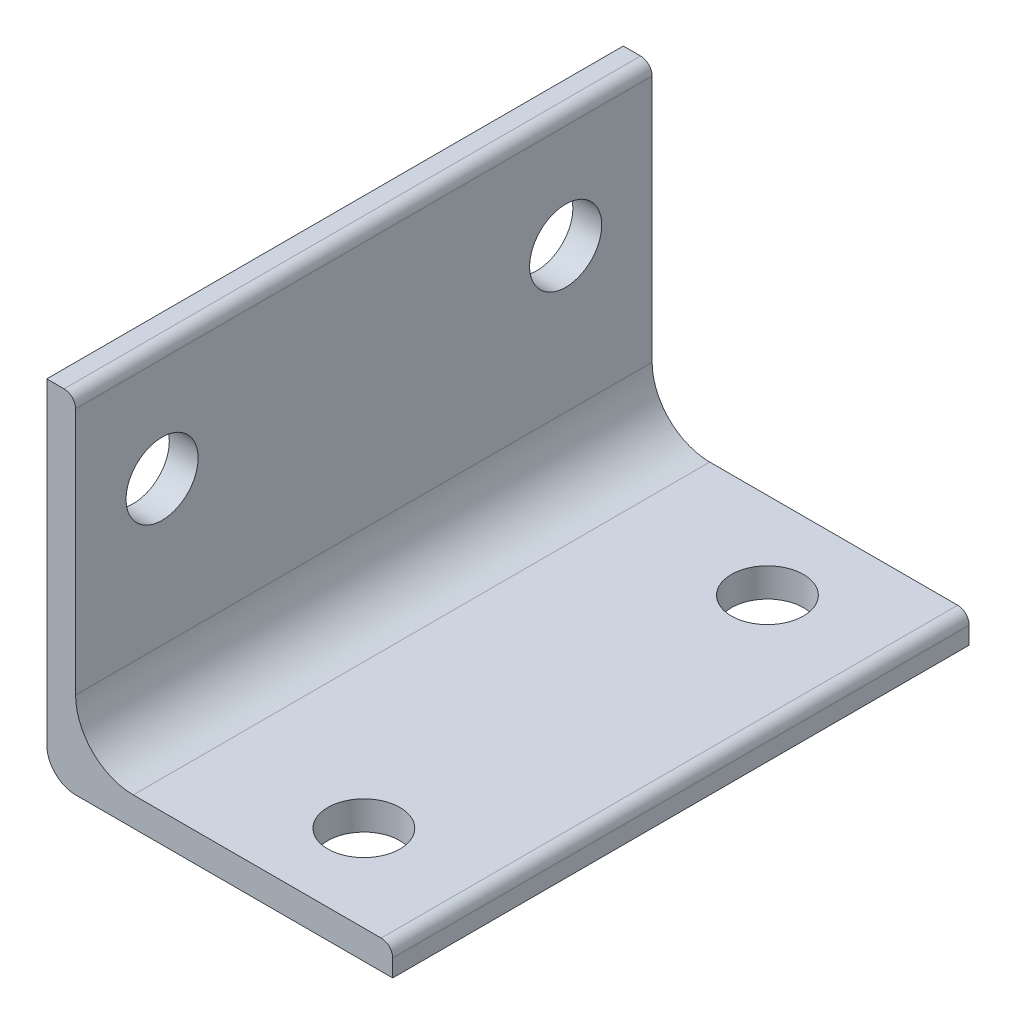
ISO-10303-21;
HEADER;
FILE_DESCRIPTION(('STEP AP214'),'2;1');
FILE_NAME('part.step','',(''),(''),'','','');
FILE_SCHEMA(('AUTOMOTIVE_DESIGN { 1 0 10303 214 1 1 1 1 }'));
ENDSEC;
DATA;
#1=APPLICATION_CONTEXT('core data for automotive mechanical design processes');
#2=APPLICATION_PROTOCOL_DEFINITION('international standard','automotive_design',2000,#1);
#3=PRODUCT_CONTEXT('',#1,'mechanical');
#4=PRODUCT('Part','Part','',(#3));
#5=PRODUCT_RELATED_PRODUCT_CATEGORY('part','',(#4));
#6=PRODUCT_DEFINITION_FORMATION('','',#4);
#7=PRODUCT_DEFINITION_CONTEXT('part definition',#1,'design');
#8=PRODUCT_DEFINITION('design','',#6,#7);
#9=PRODUCT_DEFINITION_SHAPE('','',#8);
#10=(LENGTH_UNIT() NAMED_UNIT(*) SI_UNIT(.MILLI.,.METRE.));
#11=(NAMED_UNIT(*) PLANE_ANGLE_UNIT() SI_UNIT($,.RADIAN.));
#12=(NAMED_UNIT(*) SI_UNIT($,.STERADIAN.) SOLID_ANGLE_UNIT());
#13=UNCERTAINTY_MEASURE_WITH_UNIT(LENGTH_MEASURE(1.E-05),#10,'distance_accuracy_value','');
#14=(GEOMETRIC_REPRESENTATION_CONTEXT(3) GLOBAL_UNCERTAINTY_ASSIGNED_CONTEXT((#13)) GLOBAL_UNIT_ASSIGNED_CONTEXT((#10,
#11,#12)) REPRESENTATION_CONTEXT('',''));
#15=CARTESIAN_POINT('',(0.,0.,0.));
#16=DIRECTION('',(0.,0.,1.));
#17=DIRECTION('',(1.,0.,0.));
#18=AXIS2_PLACEMENT_3D('',#15,#16,#17);
#19=CARTESIAN_POINT('',(6.35,6.34999999999999,63.5));
#20=DIRECTION('',(0.,0.,-1.));
#21=DIRECTION('',(-1.,0.,0.));
#22=AXIS2_PLACEMENT_3D('',#19,#20,#21);
#23=CYLINDRICAL_SURFACE('',#22,6.35);
#24=CARTESIAN_POINT('',(6.35,6.34999999999999,0.));
#25=DIRECTION('',(0.,0.,-1.));
#26=DIRECTION('',(1.,0.,0.));
#27=AXIS2_PLACEMENT_3D('',#24,#25,#26);
#28=CIRCLE('',#27,6.35);
#29=CARTESIAN_POINT('',(6.35,0.,0.));
#30=VERTEX_POINT('',#29);
#31=CARTESIAN_POINT('',(0.,6.34999999999999,0.));
#32=VERTEX_POINT('',#31);
#33=EDGE_CURVE('E152',#30,#32,#28,.T.);
#34=ORIENTED_EDGE('',*,*,#33,.T.);
#35=DIRECTION('',(0.,0.,-1.));
#36=VECTOR('',#35,1.);
#37=CARTESIAN_POINT('',(0.,6.34999999999999,63.5));
#38=LINE('',#37,#36);
#39=CARTESIAN_POINT('',(0.,6.34999999999999,63.5));
#40=VERTEX_POINT('',#39);
#41=EDGE_CURVE('E11',#40,#32,#38,.T.);
#42=ORIENTED_EDGE('',*,*,#41,.F.);
#43=CARTESIAN_POINT('',(6.35,6.34999999999999,63.5));
#44=DIRECTION('',(0.,0.,-1.));
#45=DIRECTION('',(1.,0.,0.));
#46=AXIS2_PLACEMENT_3D('',#43,#44,#45);
#47=CIRCLE('',#46,6.35);
#48=CARTESIAN_POINT('',(6.35,0.,63.5));
#49=VERTEX_POINT('',#48);
#50=EDGE_CURVE('E181',#49,#40,#47,.T.);
#51=ORIENTED_EDGE('',*,*,#50,.F.);
#52=DIRECTION('',(0.,0.,-1.));
#53=VECTOR('',#52,1.);
#54=CARTESIAN_POINT('',(6.35,0.,63.5));
#55=LINE('',#54,#53);
#56=EDGE_CURVE('E148',#49,#30,#55,.T.);
#57=ORIENTED_EDGE('',*,*,#56,.T.);
#58=EDGE_LOOP('',(#34,#42,#51,#57));
#59=FACE_BOUND('',#58,.T.);
#60=ADVANCED_FACE('F39',(#59),#23,.F.);
#61=CARTESIAN_POINT('',(0.,6.34999999999999,63.5));
#62=DIRECTION('',(-1.,0.,0.));
#63=DIRECTION('',(0.,-1.,0.));
#64=AXIS2_PLACEMENT_3D('',#61,#62,#63);
#65=PLANE('',#64);
#66=CARTESIAN_POINT('',(0.,22.225,9.525));
#67=DIRECTION('',(1.,0.,0.));
#68=DIRECTION('',(0.,0.,-1.));
#69=AXIS2_PLACEMENT_3D('',#66,#67,#68);
#70=CIRCLE('',#69,3.96875);
#71=CARTESIAN_POINT('',(0.,22.225,5.55625));
#72=VERTEX_POINT('',#71);
#73=EDGE_CURVE('E254',#72,#72,#70,.T.);
#74=ORIENTED_EDGE('',*,*,#73,.F.);
#75=EDGE_LOOP('',(#74));
#76=FACE_BOUND('',#75,.T.);
#77=CARTESIAN_POINT('',(0.,22.225,53.975));
#78=DIRECTION('',(1.,0.,0.));
#79=DIRECTION('',(0.,0.,-1.));
#80=AXIS2_PLACEMENT_3D('',#77,#78,#79);
#81=CIRCLE('',#80,3.96875);
#82=CARTESIAN_POINT('',(0.,22.225,50.00625));
#83=VERTEX_POINT('',#82);
#84=EDGE_CURVE('E246',#83,#83,#81,.T.);
#85=ORIENTED_EDGE('',*,*,#84,.F.);
#86=EDGE_LOOP('',(#85));
#87=FACE_BOUND('',#86,.T.);
#88=DIRECTION('',(0.,1.,0.));
#89=VECTOR('',#88,1.);
#90=CARTESIAN_POINT('',(0.,6.34999999999999,0.));
#91=LINE('',#90,#89);
#92=CARTESIAN_POINT('',(0.,33.655,0.));
#93=VERTEX_POINT('',#92);
#94=EDGE_CURVE('E156',#32,#93,#91,.T.);
#95=ORIENTED_EDGE('',*,*,#94,.T.);
#96=DIRECTION('',(0.,0.,-1.));
#97=VECTOR('',#96,1.);
#98=CARTESIAN_POINT('',(0.,33.655,63.5));
#99=LINE('',#98,#97);
#100=CARTESIAN_POINT('',(0.,33.655,63.5));
#101=VERTEX_POINT('',#100);
#102=EDGE_CURVE('E48',#101,#93,#99,.T.);
#103=ORIENTED_EDGE('',*,*,#102,.F.);
#104=DIRECTION('',(0.,1.,0.));
#105=VECTOR('',#104,1.);
#106=CARTESIAN_POINT('',(0.,6.34999999999999,63.5));
#107=LINE('',#106,#105);
#108=EDGE_CURVE('E105',#40,#101,#107,.T.);
#109=ORIENTED_EDGE('',*,*,#108,.F.);
#110=ORIENTED_EDGE('',*,*,#41,.T.);
#111=EDGE_LOOP('',(#95,#103,#109,#110));
#112=FACE_BOUND('',#111,.T.);
#113=ADVANCED_FACE('F299',(#76,#87,#112),#65,.F.);
#114=CARTESIAN_POINT('',(-1.27,33.655,63.5));
#115=DIRECTION('',(0.,0.,-1.));
#116=DIRECTION('',(-1.,0.,0.));
#117=AXIS2_PLACEMENT_3D('',#114,#115,#116);
#118=CYLINDRICAL_SURFACE('',#117,1.27);
#119=CARTESIAN_POINT('',(-1.27,33.655,0.));
#120=DIRECTION('',(0.,0.,1.));
#121=DIRECTION('',(1.,0.,0.));
#122=AXIS2_PLACEMENT_3D('',#119,#120,#121);
#123=CIRCLE('',#122,1.27);
#124=CARTESIAN_POINT('',(-1.27,34.925,0.));
#125=VERTEX_POINT('',#124);
#126=EDGE_CURVE('E160',#93,#125,#123,.T.);
#127=ORIENTED_EDGE('',*,*,#126,.T.);
#128=DIRECTION('',(0.,0.,-1.));
#129=VECTOR('',#128,1.);
#130=CARTESIAN_POINT('',(-1.27,34.925,63.5));
#131=LINE('',#130,#129);
#132=CARTESIAN_POINT('',(-1.27,34.925,63.5));
#133=VERTEX_POINT('',#132);
#134=EDGE_CURVE('E200',#133,#125,#131,.T.);
#135=ORIENTED_EDGE('',*,*,#134,.F.);
#136=CARTESIAN_POINT('',(-1.27,33.655,63.5));
#137=DIRECTION('',(0.,0.,1.));
#138=DIRECTION('',(1.,0.,0.));
#139=AXIS2_PLACEMENT_3D('',#136,#137,#138);
#140=CIRCLE('',#139,1.27);
#141=EDGE_CURVE('E210',#101,#133,#140,.T.);
#142=ORIENTED_EDGE('',*,*,#141,.F.);
#143=ORIENTED_EDGE('',*,*,#102,.T.);
#144=EDGE_LOOP('',(#127,#135,#142,#143));
#145=FACE_BOUND('',#144,.T.);
#146=ADVANCED_FACE('F208',(#145),#118,.T.);
#147=CARTESIAN_POINT('',(-1.27,34.925,63.5));
#148=DIRECTION('',(0.,-1.,0.));
#149=DIRECTION('',(0.,0.,-1.));
#150=AXIS2_PLACEMENT_3D('',#147,#148,#149);
#151=PLANE('',#150);
#152=DIRECTION('',(-1.,0.,0.));
#153=VECTOR('',#152,1.);
#154=CARTESIAN_POINT('',(-1.27,34.925,0.));
#155=LINE('',#154,#153);
#156=CARTESIAN_POINT('',(-3.175,34.925,0.));
#157=VERTEX_POINT('',#156);
#158=EDGE_CURVE('E163',#125,#157,#155,.T.);
#159=ORIENTED_EDGE('',*,*,#158,.T.);
#160=DIRECTION('',(0.,0.,-1.));
#161=VECTOR('',#160,1.);
#162=CARTESIAN_POINT('',(-3.175,34.925,63.5));
#163=LINE('',#162,#161);
#164=CARTESIAN_POINT('',(-3.175,34.925,63.5));
#165=VERTEX_POINT('',#164);
#166=EDGE_CURVE('E196',#165,#157,#163,.T.);
#167=ORIENTED_EDGE('',*,*,#166,.F.);
#168=DIRECTION('',(-1.,0.,0.));
#169=VECTOR('',#168,1.);
#170=CARTESIAN_POINT('',(-1.27,34.925,63.5));
#171=LINE('',#170,#169);
#172=EDGE_CURVE('E229',#133,#165,#171,.T.);
#173=ORIENTED_EDGE('',*,*,#172,.F.);
#174=ORIENTED_EDGE('',*,*,#134,.T.);
#175=EDGE_LOOP('',(#159,#167,#173,#174));
#176=FACE_BOUND('',#175,.T.);
#177=ADVANCED_FACE('F219',(#176),#151,.F.);
#178=CARTESIAN_POINT('',(-3.175,34.925,63.5));
#179=DIRECTION('',(1.,0.,0.));
#180=DIRECTION('',(0.,1.,0.));
#181=AXIS2_PLACEMENT_3D('',#178,#179,#180);
#182=PLANE('',#181);
#183=CARTESIAN_POINT('',(-3.17499999999999,22.225,9.525));
#184=DIRECTION('',(1.,0.,0.));
#185=DIRECTION('',(0.,0.,-1.));
#186=AXIS2_PLACEMENT_3D('',#183,#184,#185);
#187=CIRCLE('',#186,3.96875);
#188=CARTESIAN_POINT('',(-3.17499999999999,22.225,5.55625));
#189=VERTEX_POINT('',#188);
#190=EDGE_CURVE('E250',#189,#189,#187,.T.);
#191=ORIENTED_EDGE('',*,*,#190,.T.);
#192=EDGE_LOOP('',(#191));
#193=FACE_BOUND('',#192,.T.);
#194=CARTESIAN_POINT('',(-3.17499999999999,22.225,53.975));
#195=DIRECTION('',(1.,0.,0.));
#196=DIRECTION('',(0.,0.,-1.));
#197=AXIS2_PLACEMENT_3D('',#194,#195,#196);
#198=CIRCLE('',#197,3.96875);
#199=CARTESIAN_POINT('',(-3.17499999999999,22.225,50.00625));
#200=VERTEX_POINT('',#199);
#201=EDGE_CURVE('E157',#200,#200,#198,.T.);
#202=ORIENTED_EDGE('',*,*,#201,.T.);
#203=EDGE_LOOP('',(#202));
#204=FACE_BOUND('',#203,.T.);
#205=DIRECTION('',(0.,-1.,0.));
#206=VECTOR('',#205,1.);
#207=CARTESIAN_POINT('',(-3.175,34.925,0.));
#208=LINE('',#207,#206);
#209=CARTESIAN_POINT('',(-3.175,0.,0.));
#210=VERTEX_POINT('',#209);
#211=EDGE_CURVE('E166',#157,#210,#208,.T.);
#212=ORIENTED_EDGE('',*,*,#211,.T.);
#213=DIRECTION('',(0.,0.,-1.));
#214=VECTOR('',#213,1.);
#215=CARTESIAN_POINT('',(-3.175,0.,63.5));
#216=LINE('',#215,#214);
#217=CARTESIAN_POINT('',(-3.175,0.,63.5));
#218=VERTEX_POINT('',#217);
#219=EDGE_CURVE('E192',#218,#210,#216,.T.);
#220=ORIENTED_EDGE('',*,*,#219,.F.);
#221=DIRECTION('',(0.,-1.,0.));
#222=VECTOR('',#221,1.);
#223=CARTESIAN_POINT('',(-3.175,34.925,63.5));
#224=LINE('',#223,#222);
#225=EDGE_CURVE('E225',#165,#218,#224,.T.);
#226=ORIENTED_EDGE('',*,*,#225,.F.);
#227=ORIENTED_EDGE('',*,*,#166,.T.);
#228=EDGE_LOOP('',(#212,#220,#226,#227));
#229=FACE_BOUND('',#228,.T.);
#230=ADVANCED_FACE('F223',(#193,#204,#229),#182,.F.);
#231=CARTESIAN_POINT('',(0.,0.,63.5));
#232=DIRECTION('',(0.,0.,-1.));
#233=DIRECTION('',(-1.,0.,0.));
#234=AXIS2_PLACEMENT_3D('',#231,#232,#233);
#235=CYLINDRICAL_SURFACE('',#234,3.17499999999998);
#236=CARTESIAN_POINT('',(0.,0.,0.));
#237=DIRECTION('',(0.,0.,1.));
#238=DIRECTION('',(1.,0.,0.));
#239=AXIS2_PLACEMENT_3D('',#236,#237,#238);
#240=CIRCLE('',#239,3.17499999999998);
#241=CARTESIAN_POINT('',(0.,-3.17499999999999,0.));
#242=VERTEX_POINT('',#241);
#243=EDGE_CURVE('E169',#210,#242,#240,.T.);
#244=ORIENTED_EDGE('',*,*,#243,.T.);
#245=DIRECTION('',(0.,0.,-1.));
#246=VECTOR('',#245,1.);
#247=CARTESIAN_POINT('',(0.,-3.17499999999999,63.5));
#248=LINE('',#247,#246);
#249=CARTESIAN_POINT('',(0.,-3.17499999999999,63.5));
#250=VERTEX_POINT('',#249);
#251=EDGE_CURVE('E188',#250,#242,#248,.T.);
#252=ORIENTED_EDGE('',*,*,#251,.F.);
#253=CARTESIAN_POINT('',(0.,0.,63.5));
#254=DIRECTION('',(0.,0.,1.));
#255=DIRECTION('',(1.,0.,0.));
#256=AXIS2_PLACEMENT_3D('',#253,#254,#255);
#257=CIRCLE('',#256,3.17499999999998);
#258=EDGE_CURVE('E228',#218,#250,#257,.T.);
#259=ORIENTED_EDGE('',*,*,#258,.F.);
#260=ORIENTED_EDGE('',*,*,#219,.T.);
#261=EDGE_LOOP('',(#244,#252,#259,#260));
#262=FACE_BOUND('',#261,.T.);
#263=ADVANCED_FACE('F312',(#262),#235,.T.);
#264=CARTESIAN_POINT('',(0.,-3.17499999999999,63.5));
#265=DIRECTION('',(0.,1.,0.));
#266=DIRECTION('',(-1.,0.,0.));
#267=AXIS2_PLACEMENT_3D('',#264,#265,#266);
#268=PLANE('',#267);
#269=CARTESIAN_POINT('',(22.225,-3.17499999999999,53.975));
#270=DIRECTION('',(0.,1.,0.));
#271=DIRECTION('',(0.,0.,1.));
#272=AXIS2_PLACEMENT_3D('',#269,#270,#271);
#273=CIRCLE('',#272,3.96875);
#274=CARTESIAN_POINT('',(22.225,-3.17499999999999,57.94375));
#275=VERTEX_POINT('',#274);
#276=EDGE_CURVE('E266',#275,#275,#273,.T.);
#277=ORIENTED_EDGE('',*,*,#276,.T.);
#278=EDGE_LOOP('',(#277));
#279=FACE_BOUND('',#278,.T.);
#280=CARTESIAN_POINT('',(22.225,-3.17499999999999,9.525));
#281=DIRECTION('',(0.,1.,0.));
#282=DIRECTION('',(0.,0.,1.));
#283=AXIS2_PLACEMENT_3D('',#280,#281,#282);
#284=CIRCLE('',#283,3.96875);
#285=CARTESIAN_POINT('',(22.225,-3.17499999999999,13.49375));
#286=VERTEX_POINT('',#285);
#287=EDGE_CURVE('E258',#286,#286,#284,.T.);
#288=ORIENTED_EDGE('',*,*,#287,.T.);
#289=EDGE_LOOP('',(#288));
#290=FACE_BOUND('',#289,.T.);
#291=DIRECTION('',(1.,0.,0.));
#292=VECTOR('',#291,1.);
#293=CARTESIAN_POINT('',(0.,-3.17499999999999,0.));
#294=LINE('',#293,#292);
#295=CARTESIAN_POINT('',(34.925,-3.17499999999999,0.));
#296=VERTEX_POINT('',#295);
#297=EDGE_CURVE('E172',#242,#296,#294,.T.);
#298=ORIENTED_EDGE('',*,*,#297,.T.);
#299=DIRECTION('',(0.,0.,-1.));
#300=VECTOR('',#299,1.);
#301=CARTESIAN_POINT('',(34.925,-3.17499999999999,63.5));
#302=LINE('',#301,#300);
#303=CARTESIAN_POINT('',(34.925,-3.17499999999999,63.5));
#304=VERTEX_POINT('',#303);
#305=EDGE_CURVE('E141',#304,#296,#302,.T.);
#306=ORIENTED_EDGE('',*,*,#305,.F.);
#307=DIRECTION('',(1.,0.,0.));
#308=VECTOR('',#307,1.);
#309=CARTESIAN_POINT('',(0.,-3.17499999999999,63.5));
#310=LINE('',#309,#308);
#311=EDGE_CURVE('E130',#250,#304,#310,.T.);
#312=ORIENTED_EDGE('',*,*,#311,.F.);
#313=ORIENTED_EDGE('',*,*,#251,.T.);
#314=EDGE_LOOP('',(#298,#306,#312,#313));
#315=FACE_BOUND('',#314,.T.);
#316=ADVANCED_FACE('F309',(#279,#290,#315),#268,.F.);
#317=CARTESIAN_POINT('',(34.925,-3.17499999999999,63.5));
#318=DIRECTION('',(-1.,0.,0.));
#319=DIRECTION('',(0.,-1.,0.));
#320=AXIS2_PLACEMENT_3D('',#317,#318,#319);
#321=PLANE('',#320);
#322=DIRECTION('',(0.,1.,0.));
#323=VECTOR('',#322,1.);
#324=CARTESIAN_POINT('',(34.925,-3.17499999999999,0.));
#325=LINE('',#324,#323);
#326=CARTESIAN_POINT('',(34.925,-1.27,0.));
#327=VERTEX_POINT('',#326);
#328=EDGE_CURVE('E139',#296,#327,#325,.T.);
#329=ORIENTED_EDGE('',*,*,#328,.T.);
#330=DIRECTION('',(0.,0.,-1.));
#331=VECTOR('',#330,1.);
#332=CARTESIAN_POINT('',(34.925,-1.27,63.5));
#333=LINE('',#332,#331);
#334=CARTESIAN_POINT('',(34.925,-1.27,63.5));
#335=VERTEX_POINT('',#334);
#336=EDGE_CURVE('E136',#335,#327,#333,.T.);
#337=ORIENTED_EDGE('',*,*,#336,.F.);
#338=DIRECTION('',(0.,1.,0.));
#339=VECTOR('',#338,1.);
#340=CARTESIAN_POINT('',(34.925,-3.17499999999999,63.5));
#341=LINE('',#340,#339);
#342=EDGE_CURVE('E124',#304,#335,#341,.T.);
#343=ORIENTED_EDGE('',*,*,#342,.F.);
#344=ORIENTED_EDGE('',*,*,#305,.T.);
#345=EDGE_LOOP('',(#329,#337,#343,#344));
#346=FACE_BOUND('',#345,.T.);
#347=ADVANCED_FACE('F137',(#346),#321,.F.);
#348=CARTESIAN_POINT('',(33.655,-1.27,63.5));
#349=DIRECTION('',(0.,0.,-1.));
#350=DIRECTION('',(-1.,0.,0.));
#351=AXIS2_PLACEMENT_3D('',#348,#349,#350);
#352=CYLINDRICAL_SURFACE('',#351,1.27);
#353=CARTESIAN_POINT('',(33.655,-1.27,0.));
#354=DIRECTION('',(0.,0.,1.));
#355=DIRECTION('',(1.,0.,0.));
#356=AXIS2_PLACEMENT_3D('',#353,#354,#355);
#357=CIRCLE('',#356,1.27);
#358=CARTESIAN_POINT('',(33.655,0.,0.));
#359=VERTEX_POINT('',#358);
#360=EDGE_CURVE('E91',#327,#359,#357,.T.);
#361=ORIENTED_EDGE('',*,*,#360,.T.);
#362=DIRECTION('',(0.,0.,-1.));
#363=VECTOR('',#362,1.);
#364=CARTESIAN_POINT('',(33.655,0.,63.5));
#365=LINE('',#364,#363);
#366=CARTESIAN_POINT('',(33.655,0.,63.5));
#367=VERTEX_POINT('',#366);
#368=EDGE_CURVE('E142',#367,#359,#365,.T.);
#369=ORIENTED_EDGE('',*,*,#368,.F.);
#370=CARTESIAN_POINT('',(33.655,-1.27,63.5));
#371=DIRECTION('',(0.,0.,1.));
#372=DIRECTION('',(1.,0.,0.));
#373=AXIS2_PLACEMENT_3D('',#370,#371,#372);
#374=CIRCLE('',#373,1.27);
#375=EDGE_CURVE('E128',#335,#367,#374,.T.);
#376=ORIENTED_EDGE('',*,*,#375,.F.);
#377=ORIENTED_EDGE('',*,*,#336,.T.);
#378=EDGE_LOOP('',(#361,#369,#376,#377));
#379=FACE_BOUND('',#378,.T.);
#380=ADVANCED_FACE('F144',(#379),#352,.T.);
#381=CARTESIAN_POINT('',(33.655,0.,63.5));
#382=DIRECTION('',(0.,-1.,0.));
#383=DIRECTION('',(1.,0.,0.));
#384=AXIS2_PLACEMENT_3D('',#381,#382,#383);
#385=PLANE('',#384);
#386=CARTESIAN_POINT('',(22.225,0.,53.975));
#387=DIRECTION('',(0.,1.,0.));
#388=DIRECTION('',(0.,0.,1.));
#389=AXIS2_PLACEMENT_3D('',#386,#387,#388);
#390=CIRCLE('',#389,3.96875);
#391=CARTESIAN_POINT('',(22.225,0.,57.94375));
#392=VERTEX_POINT('',#391);
#393=EDGE_CURVE('E270',#392,#392,#390,.T.);
#394=ORIENTED_EDGE('',*,*,#393,.F.);
#395=EDGE_LOOP('',(#394));
#396=FACE_BOUND('',#395,.T.);
#397=CARTESIAN_POINT('',(22.225,0.,9.525));
#398=DIRECTION('',(0.,1.,0.));
#399=DIRECTION('',(0.,0.,1.));
#400=AXIS2_PLACEMENT_3D('',#397,#398,#399);
#401=CIRCLE('',#400,3.96875);
#402=CARTESIAN_POINT('',(22.225,0.,13.49375));
#403=VERTEX_POINT('',#402);
#404=EDGE_CURVE('E262',#403,#403,#401,.T.);
#405=ORIENTED_EDGE('',*,*,#404,.F.);
#406=EDGE_LOOP('',(#405));
#407=FACE_BOUND('',#406,.T.);
#408=DIRECTION('',(-1.,0.,0.));
#409=VECTOR('',#408,1.);
#410=CARTESIAN_POINT('',(33.655,0.,0.));
#411=LINE('',#410,#409);
#412=EDGE_CURVE('E97',#359,#30,#411,.T.);
#413=ORIENTED_EDGE('',*,*,#412,.T.);
#414=ORIENTED_EDGE('',*,*,#56,.F.);
#415=DIRECTION('',(-1.,0.,0.));
#416=VECTOR('',#415,1.);
#417=CARTESIAN_POINT('',(33.655,0.,63.5));
#418=LINE('',#417,#416);
#419=EDGE_CURVE('E56',#367,#49,#418,.T.);
#420=ORIENTED_EDGE('',*,*,#419,.F.);
#421=ORIENTED_EDGE('',*,*,#368,.T.);
#422=EDGE_LOOP('',(#413,#414,#420,#421));
#423=FACE_BOUND('',#422,.T.);
#424=ADVANCED_FACE('F277',(#396,#407,#423),#385,.F.);
#425=CARTESIAN_POINT('',(6.35,6.34999999999999,63.5));
#426=DIRECTION('',(0.,0.,1.));
#427=DIRECTION('',(1.,0.,0.));
#428=AXIS2_PLACEMENT_3D('',#425,#426,#427);
#429=PLANE('',#428);
#430=ORIENTED_EDGE('',*,*,#50,.T.);
#431=ORIENTED_EDGE('',*,*,#108,.T.);
#432=ORIENTED_EDGE('',*,*,#141,.T.);
#433=ORIENTED_EDGE('',*,*,#172,.T.);
#434=ORIENTED_EDGE('',*,*,#225,.T.);
#435=ORIENTED_EDGE('',*,*,#258,.T.);
#436=ORIENTED_EDGE('',*,*,#311,.T.);
#437=ORIENTED_EDGE('',*,*,#342,.T.);
#438=ORIENTED_EDGE('',*,*,#375,.T.);
#439=ORIENTED_EDGE('',*,*,#419,.T.);
#440=EDGE_LOOP('',(#430,#431,#432,#433,#434,#435,#436,#437,#438,#439));
#441=FACE_BOUND('',#440,.T.);
#442=ADVANCED_FACE('F126',(#441),#429,.T.);
#443=CARTESIAN_POINT('',(6.35,6.34999999999999,0.));
#444=DIRECTION('',(0.,0.,1.));
#445=DIRECTION('',(1.,0.,0.));
#446=AXIS2_PLACEMENT_3D('',#443,#444,#445);
#447=PLANE('',#446);
#448=ORIENTED_EDGE('',*,*,#33,.F.);
#449=ORIENTED_EDGE('',*,*,#412,.F.);
#450=ORIENTED_EDGE('',*,*,#360,.F.);
#451=ORIENTED_EDGE('',*,*,#328,.F.);
#452=ORIENTED_EDGE('',*,*,#297,.F.);
#453=ORIENTED_EDGE('',*,*,#243,.F.);
#454=ORIENTED_EDGE('',*,*,#211,.F.);
#455=ORIENTED_EDGE('',*,*,#158,.F.);
#456=ORIENTED_EDGE('',*,*,#126,.F.);
#457=ORIENTED_EDGE('',*,*,#94,.F.);
#458=EDGE_LOOP('',(#448,#449,#450,#451,#452,#453,#454,#455,#456,#457));
#459=FACE_BOUND('',#458,.T.);
#460=ADVANCED_FACE('F214',(#459),#447,.F.);
#461=CARTESIAN_POINT('',(0.,22.225,53.975));
#462=DIRECTION('',(1.,0.,0.));
#463=DIRECTION('',(0.,0.,-1.));
#464=AXIS2_PLACEMENT_3D('',#461,#462,#463);
#465=CYLINDRICAL_SURFACE('',#464,3.96875);
#466=ORIENTED_EDGE('',*,*,#201,.F.);
#467=EDGE_LOOP('',(#466));
#468=FACE_BOUND('',#467,.T.);
#469=ORIENTED_EDGE('',*,*,#84,.T.);
#470=EDGE_LOOP('',(#469));
#471=FACE_BOUND('',#470,.T.);
#472=ADVANCED_FACE('F294',(#468,#471),#465,.F.);
#473=CARTESIAN_POINT('',(0.,22.225,9.525));
#474=DIRECTION('',(1.,0.,0.));
#475=DIRECTION('',(0.,0.,-1.));
#476=AXIS2_PLACEMENT_3D('',#473,#474,#475);
#477=CYLINDRICAL_SURFACE('',#476,3.96875);
#478=ORIENTED_EDGE('',*,*,#190,.F.);
#479=EDGE_LOOP('',(#478));
#480=FACE_BOUND('',#479,.T.);
#481=ORIENTED_EDGE('',*,*,#73,.T.);
#482=EDGE_LOOP('',(#481));
#483=FACE_BOUND('',#482,.T.);
#484=ADVANCED_FACE('F285',(#480,#483),#477,.F.);
#485=CARTESIAN_POINT('',(22.225,0.,9.525));
#486=DIRECTION('',(0.,1.,0.));
#487=DIRECTION('',(0.,0.,1.));
#488=AXIS2_PLACEMENT_3D('',#485,#486,#487);
#489=CYLINDRICAL_SURFACE('',#488,3.96875);
#490=ORIENTED_EDGE('',*,*,#287,.F.);
#491=EDGE_LOOP('',(#490));
#492=FACE_BOUND('',#491,.T.);
#493=ORIENTED_EDGE('',*,*,#404,.T.);
#494=EDGE_LOOP('',(#493));
#495=FACE_BOUND('',#494,.T.);
#496=ADVANCED_FACE('F283',(#492,#495),#489,.F.);
#497=CARTESIAN_POINT('',(22.225,0.,53.975));
#498=DIRECTION('',(0.,1.,0.));
#499=DIRECTION('',(0.,0.,1.));
#500=AXIS2_PLACEMENT_3D('',#497,#498,#499);
#501=CYLINDRICAL_SURFACE('',#500,3.96875);
#502=ORIENTED_EDGE('',*,*,#276,.F.);
#503=EDGE_LOOP('',(#502));
#504=FACE_BOUND('',#503,.T.);
#505=ORIENTED_EDGE('',*,*,#393,.T.);
#506=EDGE_LOOP('',(#505));
#507=FACE_BOUND('',#506,.T.);
#508=ADVANCED_FACE('F275',(#504,#507),#501,.F.);
#509=CLOSED_SHELL('',(#60,#113,#146,#177,#230,#263,#316,#347,#380,#424,#442,#460,#472,#484,#496,#508));
#510=MANIFOLD_SOLID_BREP('B2',#509);
#511=ADVANCED_BREP_SHAPE_REPRESENTATION('',(#18,#510),#14);
#512=SHAPE_DEFINITION_REPRESENTATION(#9,#511);
ENDSEC;
END-ISO-10303-21;
